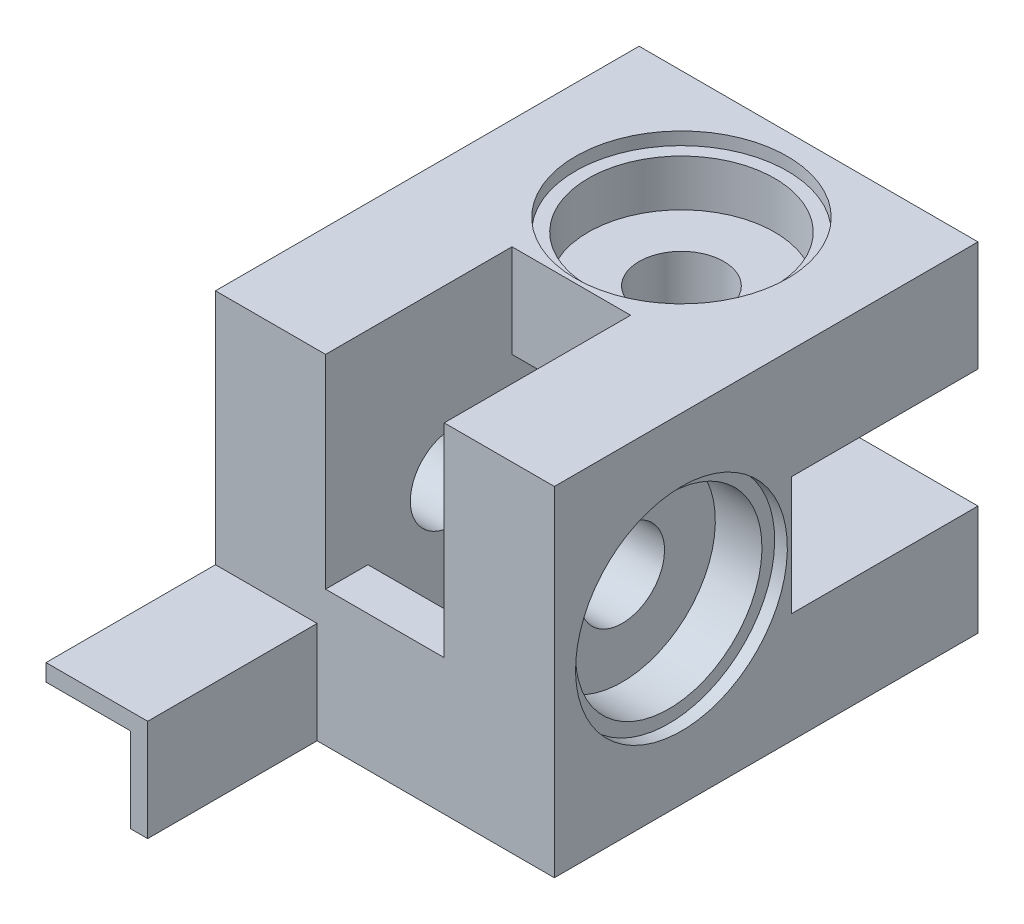
ISO-10303-21;
HEADER;
FILE_DESCRIPTION(('STEP AP214'),'2;1');
FILE_NAME('part.step','',(''),(''),'','','');
FILE_SCHEMA(('AUTOMOTIVE_DESIGN { 1 0 10303 214 1 1 1 1 }'));
ENDSEC;
DATA;
#1=APPLICATION_CONTEXT('core data for automotive mechanical design processes');
#2=APPLICATION_PROTOCOL_DEFINITION('international standard','automotive_design',2000,#1);
#3=PRODUCT_CONTEXT('',#1,'mechanical');
#4=PRODUCT('Part','Part','',(#3));
#5=PRODUCT_RELATED_PRODUCT_CATEGORY('part','',(#4));
#6=PRODUCT_DEFINITION_FORMATION('','',#4);
#7=PRODUCT_DEFINITION_CONTEXT('part definition',#1,'design');
#8=PRODUCT_DEFINITION('design','',#6,#7);
#9=PRODUCT_DEFINITION_SHAPE('','',#8);
#10=(LENGTH_UNIT() NAMED_UNIT(*) SI_UNIT(.MILLI.,.METRE.));
#11=(NAMED_UNIT(*) PLANE_ANGLE_UNIT() SI_UNIT($,.RADIAN.));
#12=(NAMED_UNIT(*) SI_UNIT($,.STERADIAN.) SOLID_ANGLE_UNIT());
#13=UNCERTAINTY_MEASURE_WITH_UNIT(LENGTH_MEASURE(1.E-05),#10,'distance_accuracy_value','');
#14=(GEOMETRIC_REPRESENTATION_CONTEXT(3) GLOBAL_UNCERTAINTY_ASSIGNED_CONTEXT((#13)) GLOBAL_UNIT_ASSIGNED_CONTEXT((#10,
#11,#12)) REPRESENTATION_CONTEXT('',''));
#15=CARTESIAN_POINT('',(0.,0.,0.));
#16=DIRECTION('',(0.,0.,1.));
#17=DIRECTION('',(1.,0.,0.));
#18=AXIS2_PLACEMENT_3D('',#15,#16,#17);
#19=CARTESIAN_POINT('',(0.,0.,50.));
#20=DIRECTION('',(0.,0.,1.));
#21=DIRECTION('',(1.,0.,0.));
#22=AXIS2_PLACEMENT_3D('',#19,#20,#21);
#23=PLANE('',#22);
#24=DIRECTION('',(-1.,0.,0.));
#25=VECTOR('',#24,1.);
#26=CARTESIAN_POINT('',(-28.,12.,50.));
#27=LINE('',#26,#25);
#28=CARTESIAN_POINT('',(-28.,12.,50.));
#29=VERTEX_POINT('',#28);
#30=CARTESIAN_POINT('',(-40.,12.,50.));
#31=VERTEX_POINT('',#30);
#32=EDGE_CURVE('E50',#29,#31,#27,.T.);
#33=ORIENTED_EDGE('',*,*,#32,.F.);
#34=DIRECTION('',(0.,1.,0.));
#35=VECTOR('',#34,1.);
#36=CARTESIAN_POINT('',(-28.,0.,50.));
#37=LINE('',#36,#35);
#38=CARTESIAN_POINT('',(-28.,0.,50.));
#39=VERTEX_POINT('',#38);
#40=EDGE_CURVE('E54',#39,#29,#37,.T.);
#41=ORIENTED_EDGE('',*,*,#40,.F.);
#42=DIRECTION('',(1.,0.,0.));
#43=VECTOR('',#42,1.);
#44=CARTESIAN_POINT('',(-40.,0.,50.));
#45=LINE('',#44,#43);
#46=CARTESIAN_POINT('',(0.,0.,50.));
#47=VERTEX_POINT('',#46);
#48=EDGE_CURVE('E428',#39,#47,#45,.T.);
#49=ORIENTED_EDGE('',*,*,#48,.T.);
#50=DIRECTION('',(0.,1.,0.));
#51=VECTOR('',#50,1.);
#52=CARTESIAN_POINT('',(0.,40.,50.));
#53=LINE('',#52,#51);
#54=CARTESIAN_POINT('',(0.,40.,50.));
#55=VERTEX_POINT('',#54);
#56=EDGE_CURVE('E479',#47,#55,#53,.T.);
#57=ORIENTED_EDGE('',*,*,#56,.T.);
#58=DIRECTION('',(-1.,0.,0.));
#59=VECTOR('',#58,1.);
#60=CARTESIAN_POINT('',(-40.,40.,50.));
#61=LINE('',#60,#59);
#62=CARTESIAN_POINT('',(-13.,40.,50.));
#63=VERTEX_POINT('',#62);
#64=EDGE_CURVE('E467',#55,#63,#61,.T.);
#65=ORIENTED_EDGE('',*,*,#64,.T.);
#66=DIRECTION('',(0.,1.,0.));
#67=VECTOR('',#66,1.);
#68=CARTESIAN_POINT('',(-13.,16.,50.));
#69=LINE('',#68,#67);
#70=CARTESIAN_POINT('',(-13.,16.,50.));
#71=VERTEX_POINT('',#70);
#72=EDGE_CURVE('E309',#71,#63,#69,.T.);
#73=ORIENTED_EDGE('',*,*,#72,.F.);
#74=DIRECTION('',(1.,0.,0.));
#75=VECTOR('',#74,1.);
#76=CARTESIAN_POINT('',(-27.,16.,50.));
#77=LINE('',#76,#75);
#78=CARTESIAN_POINT('',(-27.,16.,50.));
#79=VERTEX_POINT('',#78);
#80=EDGE_CURVE('E290',#79,#71,#77,.T.);
#81=ORIENTED_EDGE('',*,*,#80,.F.);
#82=DIRECTION('',(0.,1.,0.));
#83=VECTOR('',#82,1.);
#84=CARTESIAN_POINT('',(-27.,16.,50.));
#85=LINE('',#84,#83);
#86=CARTESIAN_POINT('',(-27.,40.,50.));
#87=VERTEX_POINT('',#86);
#88=EDGE_CURVE('E296',#79,#87,#85,.T.);
#89=ORIENTED_EDGE('',*,*,#88,.T.);
#90=CARTESIAN_POINT('',(-40.,40.,50.));
#91=VERTEX_POINT('',#90);
#92=EDGE_CURVE('E478',#87,#91,#61,.T.);
#93=ORIENTED_EDGE('',*,*,#92,.T.);
#94=DIRECTION('',(0.,-1.,0.));
#95=VECTOR('',#94,1.);
#96=CARTESIAN_POINT('',(-40.,40.,50.));
#97=LINE('',#96,#95);
#98=EDGE_CURVE('E426',#91,#31,#97,.T.);
#99=ORIENTED_EDGE('',*,*,#98,.T.);
#100=EDGE_LOOP('',(#33,#41,#49,#57,#65,#73,#81,#89,#93,#99));
#101=FACE_BOUND('',#100,.T.);
#102=ADVANCED_FACE('F33',(#101),#23,.T.);
#103=CARTESIAN_POINT('',(-20.,33.,15.));
#104=DIRECTION('',(0.,1.,0.));
#105=DIRECTION('',(0.,0.,1.));
#106=AXIS2_PLACEMENT_3D('',#103,#104,#105);
#107=CYLINDRICAL_SURFACE('',#106,11.);
#108=CARTESIAN_POINT('',(-20.,33.,15.));
#109=DIRECTION('',(0.,1.,0.));
#110=DIRECTION('',(0.,0.,1.));
#111=AXIS2_PLACEMENT_3D('',#108,#109,#110);
#112=CIRCLE('',#111,11.);
#113=CARTESIAN_POINT('',(-20.,33.,26.));
#114=VERTEX_POINT('',#113);
#115=EDGE_CURVE('E272',#114,#114,#112,.T.);
#116=ORIENTED_EDGE('',*,*,#115,.F.);
#117=EDGE_LOOP('',(#116));
#118=FACE_BOUND('',#117,.T.);
#119=CARTESIAN_POINT('',(-20.,38.5,15.));
#120=DIRECTION('',(0.,1.,0.));
#121=DIRECTION('',(0.,0.,1.));
#122=AXIS2_PLACEMENT_3D('',#119,#120,#121);
#123=CIRCLE('',#122,11.);
#124=CARTESIAN_POINT('',(-20.,38.5,26.));
#125=VERTEX_POINT('',#124);
#126=EDGE_CURVE('E270',#125,#125,#123,.F.);
#127=ORIENTED_EDGE('',*,*,#126,.F.);
#128=EDGE_LOOP('',(#127));
#129=FACE_BOUND('',#128,.T.);
#130=ADVANCED_FACE('F513',(#118,#129),#107,.F.);
#131=CARTESIAN_POINT('',(-20.,0.,15.));
#132=DIRECTION('',(0.,1.,0.));
#133=DIRECTION('',(0.,0.,1.));
#134=AXIS2_PLACEMENT_3D('',#131,#132,#133);
#135=CYLINDRICAL_SURFACE('',#134,5.);
#136=CARTESIAN_POINT('',(-20.,27.,15.));
#137=DIRECTION('',(0.,1.,0.));
#138=DIRECTION('',(0.,0.,1.));
#139=AXIS2_PLACEMENT_3D('',#136,#137,#138);
#140=CIRCLE('',#139,5.);
#141=CARTESIAN_POINT('',(-20.,27.,20.));
#142=VERTEX_POINT('',#141);
#143=EDGE_CURVE('E399',#142,#142,#140,.F.);
#144=ORIENTED_EDGE('',*,*,#143,.T.);
#145=EDGE_LOOP('',(#144));
#146=FACE_BOUND('',#145,.T.);
#147=CARTESIAN_POINT('',(-20.,33.,15.));
#148=DIRECTION('',(0.,1.,0.));
#149=DIRECTION('',(0.,0.,1.));
#150=AXIS2_PLACEMENT_3D('',#147,#148,#149);
#151=CIRCLE('',#150,5.);
#152=CARTESIAN_POINT('',(-20.,33.,20.));
#153=VERTEX_POINT('',#152);
#154=EDGE_CURVE('E275',#153,#153,#151,.F.);
#155=ORIENTED_EDGE('',*,*,#154,.F.);
#156=EDGE_LOOP('',(#155));
#157=FACE_BOUND('',#156,.T.);
#158=ADVANCED_FACE('F521',(#146,#157),#135,.F.);
#159=CARTESIAN_POINT('',(-7.,20.,35.));
#160=DIRECTION('',(1.,0.,0.));
#161=DIRECTION('',(0.,1.,0.));
#162=AXIS2_PLACEMENT_3D('',#159,#160,#161);
#163=CYLINDRICAL_SURFACE('',#162,11.);
#164=CARTESIAN_POINT('',(-7.,20.,35.));
#165=DIRECTION('',(1.,0.,0.));
#166=DIRECTION('',(0.,1.,0.));
#167=AXIS2_PLACEMENT_3D('',#164,#165,#166);
#168=CIRCLE('',#167,11.);
#169=CARTESIAN_POINT('',(-7.,31.,35.));
#170=VERTEX_POINT('',#169);
#171=EDGE_CURVE('E283',#170,#170,#168,.T.);
#172=ORIENTED_EDGE('',*,*,#171,.F.);
#173=EDGE_LOOP('',(#172));
#174=FACE_BOUND('',#173,.T.);
#175=CARTESIAN_POINT('',(-1.5,20.,35.));
#176=DIRECTION('',(1.,0.,0.));
#177=DIRECTION('',(0.,1.,0.));
#178=AXIS2_PLACEMENT_3D('',#175,#176,#177);
#179=CIRCLE('',#178,11.);
#180=CARTESIAN_POINT('',(-1.5,31.,35.));
#181=VERTEX_POINT('',#180);
#182=EDGE_CURVE('E279',#181,#181,#179,.F.);
#183=ORIENTED_EDGE('',*,*,#182,.F.);
#184=EDGE_LOOP('',(#183));
#185=FACE_BOUND('',#184,.T.);
#186=ADVANCED_FACE('F638',(#174,#185),#163,.F.);
#187=CARTESIAN_POINT('',(0.,20.,35.));
#188=DIRECTION('',(-1.,0.,0.));
#189=DIRECTION('',(0.,0.,1.));
#190=AXIS2_PLACEMENT_3D('',#187,#188,#189);
#191=CYLINDRICAL_SURFACE('',#190,5.);
#192=CARTESIAN_POINT('',(-13.,20.,35.));
#193=DIRECTION('',(1.,0.,0.));
#194=DIRECTION('',(0.,0.,-1.));
#195=AXIS2_PLACEMENT_3D('',#192,#193,#194);
#196=CIRCLE('',#195,5.);
#197=CARTESIAN_POINT('',(-13.,20.,30.));
#198=VERTEX_POINT('',#197);
#199=EDGE_CURVE('E372',#198,#198,#196,.F.);
#200=ORIENTED_EDGE('',*,*,#199,.T.);
#201=EDGE_LOOP('',(#200));
#202=FACE_BOUND('',#201,.T.);
#203=CARTESIAN_POINT('',(-7.,20.,35.));
#204=DIRECTION('',(1.,0.,0.));
#205=DIRECTION('',(0.,1.,0.));
#206=AXIS2_PLACEMENT_3D('',#203,#204,#205);
#207=CIRCLE('',#206,5.);
#208=CARTESIAN_POINT('',(-7.,25.,35.));
#209=VERTEX_POINT('',#208);
#210=EDGE_CURVE('E286',#209,#209,#207,.F.);
#211=ORIENTED_EDGE('',*,*,#210,.F.);
#212=EDGE_LOOP('',(#211));
#213=FACE_BOUND('',#212,.T.);
#214=ADVANCED_FACE('F636',(#202,#213),#191,.F.);
#215=CARTESIAN_POINT('',(-11.,27.,25.));
#216=DIRECTION('',(0.,0.,1.));
#217=DIRECTION('',(0.,-1.,0.));
#218=AXIS2_PLACEMENT_3D('',#215,#216,#217);
#219=PLANE('',#218);
#220=DIRECTION('',(-1.,0.,0.));
#221=VECTOR('',#220,1.);
#222=CARTESIAN_POINT('',(-11.,13.,25.));
#223=LINE('',#222,#221);
#224=CARTESIAN_POINT('',(-11.,13.,25.));
#225=VERTEX_POINT('',#224);
#226=CARTESIAN_POINT('',(-13.,13.,25.));
#227=VERTEX_POINT('',#226);
#228=EDGE_CURVE('E396',#225,#227,#223,.T.);
#229=ORIENTED_EDGE('',*,*,#228,.T.);
#230=DIRECTION('',(0.,1.,0.));
#231=VECTOR('',#230,1.);
#232=CARTESIAN_POINT('',(-13.,27.,25.));
#233=LINE('',#232,#231);
#234=CARTESIAN_POINT('',(-13.,27.,25.));
#235=VERTEX_POINT('',#234);
#236=EDGE_CURVE('E445',#227,#235,#233,.T.);
#237=ORIENTED_EDGE('',*,*,#236,.T.);
#238=DIRECTION('',(-1.,0.,0.));
#239=VECTOR('',#238,1.);
#240=CARTESIAN_POINT('',(-11.,27.,25.));
#241=LINE('',#240,#239);
#242=CARTESIAN_POINT('',(-11.,27.,25.));
#243=VERTEX_POINT('',#242);
#244=EDGE_CURVE('E406',#243,#235,#241,.T.);
#245=ORIENTED_EDGE('',*,*,#244,.F.);
#246=DIRECTION('',(0.,1.,0.));
#247=VECTOR('',#246,1.);
#248=CARTESIAN_POINT('',(-11.,27.,25.));
#249=LINE('',#248,#247);
#250=EDGE_CURVE('E376',#225,#243,#249,.T.);
#251=ORIENTED_EDGE('',*,*,#250,.F.);
#252=EDGE_LOOP('',(#229,#237,#245,#251));
#253=FACE_BOUND('',#252,.T.);
#254=ADVANCED_FACE('F609',(#253),#219,.F.);
#255=CARTESIAN_POINT('',(-20.,13.,15.));
#256=DIRECTION('',(0.,-1.,0.));
#257=DIRECTION('',(0.,0.,-1.));
#258=AXIS2_PLACEMENT_3D('',#255,#256,#257);
#259=CIRCLE('',#258,5.);
#260=CARTESIAN_POINT('',(-20.,13.,10.));
#261=VERTEX_POINT('',#260);
#262=EDGE_CURVE('E414',#261,#261,#259,.F.);
#263=ORIENTED_EDGE('',*,*,#262,.T.);
#264=EDGE_LOOP('',(#263));
#265=FACE_BOUND('',#264,.T.);
#266=CARTESIAN_POINT('',(-20.,0.,15.));
#267=DIRECTION('',(0.,1.,0.));
#268=DIRECTION('',(0.,0.,1.));
#269=AXIS2_PLACEMENT_3D('',#266,#267,#268);
#270=CIRCLE('',#269,5.);
#271=CARTESIAN_POINT('',(-20.,0.,20.));
#272=VERTEX_POINT('',#271);
#273=EDGE_CURVE('E413',#272,#272,#270,.T.);
#274=ORIENTED_EDGE('',*,*,#273,.F.);
#275=EDGE_LOOP('',(#274));
#276=FACE_BOUND('',#275,.T.);
#277=ADVANCED_FACE('F640',(#265,#276),#135,.F.);
#278=CARTESIAN_POINT('',(-40.,40.,50.));
#279=DIRECTION('',(1.,0.,0.));
#280=DIRECTION('',(0.,0.,-1.));
#281=AXIS2_PLACEMENT_3D('',#278,#279,#280);
#282=PLANE('',#281);
#283=DIRECTION('',(0.,0.,-1.));
#284=VECTOR('',#283,1.);
#285=CARTESIAN_POINT('',(-40.,27.,25.));
#286=LINE('',#285,#284);
#287=CARTESIAN_POINT('',(-40.,27.,25.));
#288=VERTEX_POINT('',#287);
#289=CARTESIAN_POINT('',(-40.,27.,5.));
#290=VERTEX_POINT('',#289);
#291=EDGE_CURVE('E388',#288,#290,#286,.T.);
#292=ORIENTED_EDGE('',*,*,#291,.F.);
#293=DIRECTION('',(0.,1.,0.));
#294=VECTOR('',#293,1.);
#295=CARTESIAN_POINT('',(-40.,27.,25.));
#296=LINE('',#295,#294);
#297=CARTESIAN_POINT('',(-40.,13.,25.));
#298=VERTEX_POINT('',#297);
#299=EDGE_CURVE('E375',#298,#288,#296,.T.);
#300=ORIENTED_EDGE('',*,*,#299,.F.);
#301=DIRECTION('',(0.,0.,1.));
#302=VECTOR('',#301,1.);
#303=CARTESIAN_POINT('',(-40.,13.,25.));
#304=LINE('',#303,#302);
#305=CARTESIAN_POINT('',(-40.,13.,5.));
#306=VERTEX_POINT('',#305);
#307=EDGE_CURVE('E380',#306,#298,#304,.T.);
#308=ORIENTED_EDGE('',*,*,#307,.F.);
#309=DIRECTION('',(0.,-1.,0.));
#310=VECTOR('',#309,1.);
#311=CARTESIAN_POINT('',(-40.,27.,5.));
#312=LINE('',#311,#310);
#313=EDGE_CURVE('E391',#290,#306,#312,.T.);
#314=ORIENTED_EDGE('',*,*,#313,.F.);
#315=EDGE_LOOP('',(#292,#300,#308,#314));
#316=FACE_BOUND('',#315,.T.);
#317=CARTESIAN_POINT('',(-40.,20.,35.));
#318=DIRECTION('',(-1.,0.,0.));
#319=DIRECTION('',(0.,0.,1.));
#320=AXIS2_PLACEMENT_3D('',#317,#318,#319);
#321=CIRCLE('',#320,5.);
#322=CARTESIAN_POINT('',(-40.,20.,40.));
#323=VERTEX_POINT('',#322);
#324=EDGE_CURVE('E410',#323,#323,#321,.T.);
#325=ORIENTED_EDGE('',*,*,#324,.F.);
#326=EDGE_LOOP('',(#325));
#327=FACE_BOUND('',#326,.T.);
#328=DIRECTION('',(0.,-1.,0.));
#329=VECTOR('',#328,1.);
#330=CARTESIAN_POINT('',(-40.,40.,0.));
#331=LINE('',#330,#329);
#332=CARTESIAN_POINT('',(-40.,40.,0.));
#333=VERTEX_POINT('',#332);
#334=CARTESIAN_POINT('',(-40.,0.,0.));
#335=VERTEX_POINT('',#334);
#336=EDGE_CURVE('E417',#333,#335,#331,.T.);
#337=ORIENTED_EDGE('',*,*,#336,.T.);
#338=DIRECTION('',(0.,0.,-1.));
#339=VECTOR('',#338,1.);
#340=CARTESIAN_POINT('',(-40.,0.,50.));
#341=LINE('',#340,#339);
#342=CARTESIAN_POINT('',(-40.,0.,50.));
#343=VERTEX_POINT('',#342);
#344=EDGE_CURVE('E451',#343,#335,#341,.T.);
#345=ORIENTED_EDGE('',*,*,#344,.F.);
#346=CARTESIAN_POINT('',(-40.,10.,50.));
#347=VERTEX_POINT('',#346);
#348=EDGE_CURVE('E242',#347,#343,#97,.T.);
#349=ORIENTED_EDGE('',*,*,#348,.F.);
#350=DIRECTION('',(0.,0.,-1.));
#351=VECTOR('',#350,1.);
#352=CARTESIAN_POINT('',(-40.,10.,70.));
#353=LINE('',#352,#351);
#354=CARTESIAN_POINT('',(-40.,10.,70.));
#355=VERTEX_POINT('',#354);
#356=EDGE_CURVE('E223',#355,#347,#353,.T.);
#357=ORIENTED_EDGE('',*,*,#356,.F.);
#358=DIRECTION('',(0.,-1.,0.));
#359=VECTOR('',#358,1.);
#360=CARTESIAN_POINT('',(-40.,12.,70.));
#361=LINE('',#360,#359);
#362=CARTESIAN_POINT('',(-40.,12.,70.));
#363=VERTEX_POINT('',#362);
#364=EDGE_CURVE('E229',#363,#355,#361,.T.);
#365=ORIENTED_EDGE('',*,*,#364,.F.);
#366=DIRECTION('',(0.,0.,-1.));
#367=VECTOR('',#366,1.);
#368=CARTESIAN_POINT('',(-40.,12.,70.));
#369=LINE('',#368,#367);
#370=EDGE_CURVE('E258',#363,#31,#369,.T.);
#371=ORIENTED_EDGE('',*,*,#370,.T.);
#372=ORIENTED_EDGE('',*,*,#98,.F.);
#373=DIRECTION('',(0.,0.,-1.));
#374=VECTOR('',#373,1.);
#375=CARTESIAN_POINT('',(-40.,40.,50.));
#376=LINE('',#375,#374);
#377=EDGE_CURVE('E464',#91,#333,#376,.T.);
#378=ORIENTED_EDGE('',*,*,#377,.T.);
#379=EDGE_LOOP('',(#337,#345,#349,#357,#365,#371,#372,#378));
#380=FACE_BOUND('',#379,.T.);
#381=ADVANCED_FACE('F35',(#316,#327,#380),#282,.F.);
#382=CARTESIAN_POINT('',(-40.,0.,50.));
#383=DIRECTION('',(0.,1.,0.));
#384=DIRECTION('',(0.,0.,1.));
#385=AXIS2_PLACEMENT_3D('',#382,#383,#384);
#386=PLANE('',#385);
#387=DIRECTION('',(-1.,0.,0.));
#388=VECTOR('',#387,1.);
#389=CARTESIAN_POINT('',(-13.,0.,45.));
#390=LINE('',#389,#388);
#391=CARTESIAN_POINT('',(-13.,0.,45.));
#392=VERTEX_POINT('',#391);
#393=CARTESIAN_POINT('',(-27.,0.,45.));
#394=VERTEX_POINT('',#393);
#395=EDGE_CURVE('E350',#392,#394,#390,.T.);
#396=ORIENTED_EDGE('',*,*,#395,.F.);
#397=DIRECTION('',(0.,0.,1.));
#398=VECTOR('',#397,1.);
#399=CARTESIAN_POINT('',(-13.,0.,25.));
#400=LINE('',#399,#398);
#401=CARTESIAN_POINT('',(-13.,0.,25.));
#402=VERTEX_POINT('',#401);
#403=EDGE_CURVE('E332',#402,#392,#400,.T.);
#404=ORIENTED_EDGE('',*,*,#403,.F.);
#405=DIRECTION('',(1.,0.,0.));
#406=VECTOR('',#405,1.);
#407=CARTESIAN_POINT('',(-13.,0.,25.));
#408=LINE('',#407,#406);
#409=CARTESIAN_POINT('',(-27.,0.,25.));
#410=VERTEX_POINT('',#409);
#411=EDGE_CURVE('E342',#410,#402,#408,.T.);
#412=ORIENTED_EDGE('',*,*,#411,.F.);
#413=DIRECTION('',(0.,0.,-1.));
#414=VECTOR('',#413,1.);
#415=CARTESIAN_POINT('',(-27.,0.,25.));
#416=LINE('',#415,#414);
#417=EDGE_CURVE('E353',#394,#410,#416,.T.);
#418=ORIENTED_EDGE('',*,*,#417,.F.);
#419=EDGE_LOOP('',(#396,#404,#412,#418));
#420=FACE_BOUND('',#419,.T.);
#421=ORIENTED_EDGE('',*,*,#273,.T.);
#422=EDGE_LOOP('',(#421));
#423=FACE_BOUND('',#422,.T.);
#424=DIRECTION('',(1.,0.,0.));
#425=VECTOR('',#424,1.);
#426=CARTESIAN_POINT('',(-40.,0.,0.));
#427=LINE('',#426,#425);
#428=CARTESIAN_POINT('',(0.,0.,0.));
#429=VERTEX_POINT('',#428);
#430=EDGE_CURVE('E474',#335,#429,#427,.T.);
#431=ORIENTED_EDGE('',*,*,#430,.T.);
#432=DIRECTION('',(0.,0.,-1.));
#433=VECTOR('',#432,1.);
#434=CARTESIAN_POINT('',(0.,0.,50.));
#435=LINE('',#434,#433);
#436=EDGE_CURVE('E458',#47,#429,#435,.T.);
#437=ORIENTED_EDGE('',*,*,#436,.F.);
#438=ORIENTED_EDGE('',*,*,#48,.F.);
#439=DIRECTION('',(0.,0.,-1.));
#440=VECTOR('',#439,1.);
#441=CARTESIAN_POINT('',(-28.,0.,70.));
#442=LINE('',#441,#440);
#443=CARTESIAN_POINT('',(-28.,0.,70.));
#444=VERTEX_POINT('',#443);
#445=EDGE_CURVE('E267',#444,#39,#442,.T.);
#446=ORIENTED_EDGE('',*,*,#445,.F.);
#447=DIRECTION('',(1.,0.,0.));
#448=VECTOR('',#447,1.);
#449=CARTESIAN_POINT('',(-30.,0.,70.));
#450=LINE('',#449,#448);
#451=CARTESIAN_POINT('',(-30.,0.,70.));
#452=VERTEX_POINT('',#451);
#453=EDGE_CURVE('E510',#452,#444,#450,.T.);
#454=ORIENTED_EDGE('',*,*,#453,.F.);
#455=DIRECTION('',(0.,0.,-1.));
#456=VECTOR('',#455,1.);
#457=CARTESIAN_POINT('',(-30.,0.,70.));
#458=LINE('',#457,#456);
#459=CARTESIAN_POINT('',(-30.,0.,50.));
#460=VERTEX_POINT('',#459);
#461=EDGE_CURVE('E248',#452,#460,#458,.T.);
#462=ORIENTED_EDGE('',*,*,#461,.T.);
#463=EDGE_CURVE('E480',#343,#460,#45,.T.);
#464=ORIENTED_EDGE('',*,*,#463,.F.);
#465=ORIENTED_EDGE('',*,*,#344,.T.);
#466=EDGE_LOOP('',(#431,#437,#438,#446,#454,#462,#464,#465));
#467=FACE_BOUND('',#466,.T.);
#468=ADVANCED_FACE('F509',(#420,#423,#467),#386,.F.);
#469=CARTESIAN_POINT('',(0.,40.,50.));
#470=DIRECTION('',(-1.,0.,0.));
#471=DIRECTION('',(0.,-1.,0.));
#472=AXIS2_PLACEMENT_3D('',#469,#470,#471);
#473=PLANE('',#472);
#474=CARTESIAN_POINT('',(0.,20.,35.));
#475=DIRECTION('',(1.,0.,0.));
#476=DIRECTION('',(0.,1.,0.));
#477=AXIS2_PLACEMENT_3D('',#474,#475,#476);
#478=CIRCLE('',#477,12.5);
#479=CARTESIAN_POINT('',(0.,32.5,35.));
#480=VERTEX_POINT('',#479);
#481=EDGE_CURVE('E280',#480,#480,#478,.T.);
#482=ORIENTED_EDGE('',*,*,#481,.F.);
#483=EDGE_LOOP('',(#482));
#484=FACE_BOUND('',#483,.T.);
#485=DIRECTION('',(0.,1.,0.));
#486=VECTOR('',#485,1.);
#487=CARTESIAN_POINT('',(0.,40.,0.));
#488=LINE('',#487,#486);
#489=CARTESIAN_POINT('',(0.,13.,0.));
#490=VERTEX_POINT('',#489);
#491=EDGE_CURVE('E470',#429,#490,#488,.T.);
#492=ORIENTED_EDGE('',*,*,#491,.T.);
#493=DIRECTION('',(0.,0.,-1.));
#494=VECTOR('',#493,1.);
#495=CARTESIAN_POINT('',(0.,13.,0.));
#496=LINE('',#495,#494);
#497=CARTESIAN_POINT('',(0.,13.,22.));
#498=VERTEX_POINT('',#497);
#499=EDGE_CURVE('E317',#498,#490,#496,.T.);
#500=ORIENTED_EDGE('',*,*,#499,.F.);
#501=DIRECTION('',(0.,-1.,0.));
#502=VECTOR('',#501,1.);
#503=CARTESIAN_POINT('',(0.,27.,22.));
#504=LINE('',#503,#502);
#505=CARTESIAN_POINT('',(0.,27.,22.));
#506=VERTEX_POINT('',#505);
#507=EDGE_CURVE('E325',#506,#498,#504,.T.);
#508=ORIENTED_EDGE('',*,*,#507,.F.);
#509=DIRECTION('',(0.,0.,1.));
#510=VECTOR('',#509,1.);
#511=CARTESIAN_POINT('',(0.,27.,0.));
#512=LINE('',#511,#510);
#513=CARTESIAN_POINT('',(0.,27.,0.));
#514=VERTEX_POINT('',#513);
#515=EDGE_CURVE('E306',#514,#506,#512,.T.);
#516=ORIENTED_EDGE('',*,*,#515,.F.);
#517=CARTESIAN_POINT('',(0.,40.,0.));
#518=VERTEX_POINT('',#517);
#519=EDGE_CURVE('E473',#514,#518,#488,.T.);
#520=ORIENTED_EDGE('',*,*,#519,.T.);
#521=DIRECTION('',(0.,0.,-1.));
#522=VECTOR('',#521,1.);
#523=CARTESIAN_POINT('',(0.,40.,50.));
#524=LINE('',#523,#522);
#525=EDGE_CURVE('E461',#55,#518,#524,.T.);
#526=ORIENTED_EDGE('',*,*,#525,.F.);
#527=ORIENTED_EDGE('',*,*,#56,.F.);
#528=ORIENTED_EDGE('',*,*,#436,.T.);
#529=EDGE_LOOP('',(#492,#500,#508,#516,#520,#526,#527,#528));
#530=FACE_BOUND('',#529,.T.);
#531=ADVANCED_FACE('F537',(#484,#530),#473,.F.);
#532=CARTESIAN_POINT('',(-40.,40.,50.));
#533=DIRECTION('',(0.,-1.,0.));
#534=DIRECTION('',(0.,0.,-1.));
#535=AXIS2_PLACEMENT_3D('',#532,#533,#534);
#536=PLANE('',#535);
#537=CARTESIAN_POINT('',(-20.,40.,15.));
#538=DIRECTION('',(0.,1.,0.));
#539=DIRECTION('',(0.,0.,1.));
#540=AXIS2_PLACEMENT_3D('',#537,#538,#539);
#541=CIRCLE('',#540,12.5);
#542=CARTESIAN_POINT('',(-20.,40.,27.5));
#543=VERTEX_POINT('',#542);
#544=EDGE_CURVE('E243',#543,#543,#541,.T.);
#545=ORIENTED_EDGE('',*,*,#544,.F.);
#546=EDGE_LOOP('',(#545));
#547=FACE_BOUND('',#546,.T.);
#548=ORIENTED_EDGE('',*,*,#92,.F.);
#549=DIRECTION('',(0.,0.,1.));
#550=VECTOR('',#549,1.);
#551=CARTESIAN_POINT('',(-27.,40.,50.));
#552=LINE('',#551,#550);
#553=CARTESIAN_POINT('',(-27.,40.,28.));
#554=VERTEX_POINT('',#553);
#555=EDGE_CURVE('E297',#554,#87,#552,.T.);
#556=ORIENTED_EDGE('',*,*,#555,.F.);
#557=DIRECTION('',(-1.,0.,0.));
#558=VECTOR('',#557,1.);
#559=CARTESIAN_POINT('',(-27.,40.,28.));
#560=LINE('',#559,#558);
#561=CARTESIAN_POINT('',(-13.,40.,28.));
#562=VERTEX_POINT('',#561);
#563=EDGE_CURVE('E291',#562,#554,#560,.T.);
#564=ORIENTED_EDGE('',*,*,#563,.F.);
#565=DIRECTION('',(0.,0.,-1.));
#566=VECTOR('',#565,1.);
#567=CARTESIAN_POINT('',(-13.,40.,50.));
#568=LINE('',#567,#566);
#569=EDGE_CURVE('E299',#63,#562,#568,.T.);
#570=ORIENTED_EDGE('',*,*,#569,.F.);
#571=ORIENTED_EDGE('',*,*,#64,.F.);
#572=ORIENTED_EDGE('',*,*,#525,.T.);
#573=DIRECTION('',(-1.,0.,0.));
#574=VECTOR('',#573,1.);
#575=CARTESIAN_POINT('',(-40.,40.,0.));
#576=LINE('',#575,#574);
#577=EDGE_CURVE('E468',#518,#333,#576,.T.);
#578=ORIENTED_EDGE('',*,*,#577,.T.);
#579=ORIENTED_EDGE('',*,*,#377,.F.);
#580=EDGE_LOOP('',(#548,#556,#564,#570,#571,#572,#578,#579));
#581=FACE_BOUND('',#580,.T.);
#582=ADVANCED_FACE('F528',(#547,#581),#536,.F.);
#583=DIRECTION('',(0.,-1.,0.));
#584=VECTOR('',#583,1.);
#585=CARTESIAN_POINT('',(-30.,10.,50.));
#586=LINE('',#585,#584);
#587=CARTESIAN_POINT('',(-30.,10.,50.));
#588=VERTEX_POINT('',#587);
#589=EDGE_CURVE('E488',#588,#460,#586,.T.);
#590=ORIENTED_EDGE('',*,*,#589,.F.);
#591=DIRECTION('',(1.,0.,0.));
#592=VECTOR('',#591,1.);
#593=CARTESIAN_POINT('',(-40.,10.,50.));
#594=LINE('',#593,#592);
#595=EDGE_CURVE('E487',#347,#588,#594,.T.);
#596=ORIENTED_EDGE('',*,*,#595,.F.);
#597=ORIENTED_EDGE('',*,*,#348,.T.);
#598=ORIENTED_EDGE('',*,*,#463,.T.);
#599=EDGE_LOOP('',(#590,#596,#597,#598));
#600=FACE_BOUND('',#599,.T.);
#601=ADVANCED_FACE('F515',(#600),#23,.T.);
#602=CARTESIAN_POINT('',(0.,0.,0.));
#603=DIRECTION('',(0.,0.,1.));
#604=DIRECTION('',(1.,0.,0.));
#605=AXIS2_PLACEMENT_3D('',#602,#603,#604);
#606=PLANE('',#605);
#607=DIRECTION('',(0.,1.,0.));
#608=VECTOR('',#607,1.);
#609=CARTESIAN_POINT('',(-24.,27.,0.));
#610=LINE('',#609,#608);
#611=CARTESIAN_POINT('',(-24.,13.,0.));
#612=VERTEX_POINT('',#611);
#613=CARTESIAN_POINT('',(-24.,27.,0.));
#614=VERTEX_POINT('',#613);
#615=EDGE_CURVE('E313',#612,#614,#610,.T.);
#616=ORIENTED_EDGE('',*,*,#615,.F.);
#617=DIRECTION('',(1.,0.,0.));
#618=VECTOR('',#617,1.);
#619=CARTESIAN_POINT('',(-24.,13.,0.));
#620=LINE('',#619,#618);
#621=EDGE_CURVE('E329',#612,#490,#620,.T.);
#622=ORIENTED_EDGE('',*,*,#621,.T.);
#623=ORIENTED_EDGE('',*,*,#491,.F.);
#624=ORIENTED_EDGE('',*,*,#430,.F.);
#625=ORIENTED_EDGE('',*,*,#336,.F.);
#626=ORIENTED_EDGE('',*,*,#577,.F.);
#627=ORIENTED_EDGE('',*,*,#519,.F.);
#628=DIRECTION('',(1.,0.,0.));
#629=VECTOR('',#628,1.);
#630=CARTESIAN_POINT('',(-24.,27.,0.));
#631=LINE('',#630,#629);
#632=EDGE_CURVE('E322',#614,#514,#631,.T.);
#633=ORIENTED_EDGE('',*,*,#632,.F.);
#634=EDGE_LOOP('',(#616,#622,#623,#624,#625,#626,#627,#633));
#635=FACE_BOUND('',#634,.T.);
#636=ADVANCED_FACE('F527',(#635),#606,.F.);
#637=CARTESIAN_POINT('',(-27.,20.,35.));
#638=DIRECTION('',(-1.,0.,0.));
#639=DIRECTION('',(0.,0.,1.));
#640=AXIS2_PLACEMENT_3D('',#637,#638,#639);
#641=CIRCLE('',#640,5.);
#642=CARTESIAN_POINT('',(-27.,20.,40.));
#643=VERTEX_POINT('',#642);
#644=EDGE_CURVE('E361',#643,#643,#641,.F.);
#645=ORIENTED_EDGE('',*,*,#644,.T.);
#646=EDGE_LOOP('',(#645));
#647=FACE_BOUND('',#646,.T.);
#648=ORIENTED_EDGE('',*,*,#324,.T.);
#649=EDGE_LOOP('',(#648));
#650=FACE_BOUND('',#649,.T.);
#651=ADVANCED_FACE('F534',(#647,#650),#191,.F.);
#652=CARTESIAN_POINT('',(-11.,13.,25.));
#653=DIRECTION('',(0.,-1.,0.));
#654=DIRECTION('',(0.,0.,-1.));
#655=AXIS2_PLACEMENT_3D('',#652,#653,#654);
#656=PLANE('',#655);
#657=ORIENTED_EDGE('',*,*,#262,.F.);
#658=EDGE_LOOP('',(#657));
#659=FACE_BOUND('',#658,.T.);
#660=DIRECTION('',(0.,0.,1.));
#661=VECTOR('',#660,1.);
#662=CARTESIAN_POINT('',(-11.,13.,25.));
#663=LINE('',#662,#661);
#664=CARTESIAN_POINT('',(-11.,13.,22.));
#665=VERTEX_POINT('',#664);
#666=EDGE_CURVE('E383',#665,#225,#663,.T.);
#667=ORIENTED_EDGE('',*,*,#666,.F.);
#668=DIRECTION('',(1.,0.,0.));
#669=VECTOR('',#668,1.);
#670=CARTESIAN_POINT('',(-24.,13.,22.));
#671=LINE('',#670,#669);
#672=EDGE_CURVE('E333',#665,#498,#671,.T.);
#673=ORIENTED_EDGE('',*,*,#672,.T.);
#674=ORIENTED_EDGE('',*,*,#499,.T.);
#675=ORIENTED_EDGE('',*,*,#621,.F.);
#676=DIRECTION('',(0.,0.,-1.));
#677=VECTOR('',#676,1.);
#678=CARTESIAN_POINT('',(-24.,13.,0.));
#679=LINE('',#678,#677);
#680=CARTESIAN_POINT('',(-24.,13.,5.));
#681=VERTEX_POINT('',#680);
#682=EDGE_CURVE('E319',#681,#612,#679,.T.);
#683=ORIENTED_EDGE('',*,*,#682,.F.);
#684=DIRECTION('',(-1.,0.,0.));
#685=VECTOR('',#684,1.);
#686=CARTESIAN_POINT('',(-11.,13.,5.));
#687=LINE('',#686,#685);
#688=EDGE_CURVE('E402',#681,#306,#687,.T.);
#689=ORIENTED_EDGE('',*,*,#688,.T.);
#690=ORIENTED_EDGE('',*,*,#307,.T.);
#691=CARTESIAN_POINT('',(-27.,13.,25.));
#692=VERTEX_POINT('',#691);
#693=EDGE_CURVE('E401',#692,#298,#223,.T.);
#694=ORIENTED_EDGE('',*,*,#693,.F.);
#695=EDGE_CURVE('E400',#227,#692,#223,.T.);
#696=ORIENTED_EDGE('',*,*,#695,.F.);
#697=ORIENTED_EDGE('',*,*,#228,.F.);
#698=EDGE_LOOP('',(#667,#673,#674,#675,#683,#689,#690,#694,#696,#697));
#699=FACE_BOUND('',#698,.T.);
#700=ADVANCED_FACE('F590',(#659,#699),#656,.F.);
#701=CARTESIAN_POINT('',(-11.,27.,25.));
#702=DIRECTION('',(0.,1.,0.));
#703=DIRECTION('',(0.,0.,1.));
#704=AXIS2_PLACEMENT_3D('',#701,#702,#703);
#705=PLANE('',#704);
#706=DIRECTION('',(1.,0.,0.));
#707=VECTOR('',#706,1.);
#708=CARTESIAN_POINT('',(-24.,27.,22.));
#709=LINE('',#708,#707);
#710=CARTESIAN_POINT('',(-11.,27.,22.));
#711=VERTEX_POINT('',#710);
#712=EDGE_CURVE('E335',#711,#506,#709,.T.);
#713=ORIENTED_EDGE('',*,*,#712,.F.);
#714=DIRECTION('',(0.,0.,-1.));
#715=VECTOR('',#714,1.);
#716=CARTESIAN_POINT('',(-11.,27.,25.));
#717=LINE('',#716,#715);
#718=EDGE_CURVE('E379',#243,#711,#717,.T.);
#719=ORIENTED_EDGE('',*,*,#718,.F.);
#720=ORIENTED_EDGE('',*,*,#244,.T.);
#721=CARTESIAN_POINT('',(-27.,27.,25.));
#722=VERTEX_POINT('',#721);
#723=EDGE_CURVE('E409',#235,#722,#241,.T.);
#724=ORIENTED_EDGE('',*,*,#723,.T.);
#725=EDGE_CURVE('E385',#722,#288,#241,.T.);
#726=ORIENTED_EDGE('',*,*,#725,.T.);
#727=ORIENTED_EDGE('',*,*,#291,.T.);
#728=DIRECTION('',(-1.,0.,0.));
#729=VECTOR('',#728,1.);
#730=CARTESIAN_POINT('',(-11.,27.,5.));
#731=LINE('',#730,#729);
#732=CARTESIAN_POINT('',(-24.,27.,5.));
#733=VERTEX_POINT('',#732);
#734=EDGE_CURVE('E404',#733,#290,#731,.T.);
#735=ORIENTED_EDGE('',*,*,#734,.F.);
#736=DIRECTION('',(0.,0.,1.));
#737=VECTOR('',#736,1.);
#738=CARTESIAN_POINT('',(-24.,27.,0.));
#739=LINE('',#738,#737);
#740=EDGE_CURVE('E316',#614,#733,#739,.T.);
#741=ORIENTED_EDGE('',*,*,#740,.F.);
#742=ORIENTED_EDGE('',*,*,#632,.T.);
#743=ORIENTED_EDGE('',*,*,#515,.T.);
#744=EDGE_LOOP('',(#713,#719,#720,#724,#726,#727,#735,#741,#742,#743));
#745=FACE_BOUND('',#744,.T.);
#746=ORIENTED_EDGE('',*,*,#143,.F.);
#747=EDGE_LOOP('',(#746));
#748=FACE_BOUND('',#747,.T.);
#749=ADVANCED_FACE('F601',(#745,#748),#705,.F.);
#750=ORIENTED_EDGE('',*,*,#725,.F.);
#751=DIRECTION('',(0.,-1.,0.));
#752=VECTOR('',#751,1.);
#753=CARTESIAN_POINT('',(-27.,27.,25.));
#754=LINE('',#753,#752);
#755=EDGE_CURVE('E448',#722,#692,#754,.T.);
#756=ORIENTED_EDGE('',*,*,#755,.T.);
#757=ORIENTED_EDGE('',*,*,#693,.T.);
#758=ORIENTED_EDGE('',*,*,#299,.T.);
#759=EDGE_LOOP('',(#750,#756,#757,#758));
#760=FACE_BOUND('',#759,.T.);
#761=ADVANCED_FACE('F587',(#760),#219,.F.);
#762=CARTESIAN_POINT('',(-11.,27.,5.));
#763=DIRECTION('',(0.,0.,-1.));
#764=DIRECTION('',(0.,1.,0.));
#765=AXIS2_PLACEMENT_3D('',#762,#763,#764);
#766=PLANE('',#765);
#767=ORIENTED_EDGE('',*,*,#688,.F.);
#768=DIRECTION('',(0.,1.,0.));
#769=VECTOR('',#768,1.);
#770=CARTESIAN_POINT('',(-24.,27.,5.));
#771=LINE('',#770,#769);
#772=EDGE_CURVE('E439',#681,#733,#771,.T.);
#773=ORIENTED_EDGE('',*,*,#772,.T.);
#774=ORIENTED_EDGE('',*,*,#734,.T.);
#775=ORIENTED_EDGE('',*,*,#313,.T.);
#776=EDGE_LOOP('',(#767,#773,#774,#775));
#777=FACE_BOUND('',#776,.T.);
#778=ADVANCED_FACE('F621',(#777),#766,.F.);
#779=CARTESIAN_POINT('',(-11.,0.,0.));
#780=DIRECTION('',(1.,0.,0.));
#781=DIRECTION('',(0.,0.,-1.));
#782=AXIS2_PLACEMENT_3D('',#779,#780,#781);
#783=PLANE('',#782);
#784=ORIENTED_EDGE('',*,*,#718,.T.);
#785=DIRECTION('',(0.,-1.,0.));
#786=VECTOR('',#785,1.);
#787=CARTESIAN_POINT('',(-11.,0.,22.));
#788=LINE('',#787,#786);
#789=EDGE_CURVE('E442',#711,#665,#788,.T.);
#790=ORIENTED_EDGE('',*,*,#789,.T.);
#791=ORIENTED_EDGE('',*,*,#666,.T.);
#792=ORIENTED_EDGE('',*,*,#250,.T.);
#793=EDGE_LOOP('',(#784,#790,#791,#792));
#794=FACE_BOUND('',#793,.T.);
#795=ADVANCED_FACE('F612',(#794),#783,.F.);
#796=CARTESIAN_POINT('',(-13.,29.,25.));
#797=DIRECTION('',(0.,0.,-1.));
#798=DIRECTION('',(-1.,0.,0.));
#799=AXIS2_PLACEMENT_3D('',#796,#797,#798);
#800=PLANE('',#799);
#801=DIRECTION('',(0.,-1.,0.));
#802=VECTOR('',#801,1.);
#803=CARTESIAN_POINT('',(-27.,29.,25.));
#804=LINE('',#803,#802);
#805=EDGE_CURVE('E366',#692,#410,#804,.T.);
#806=ORIENTED_EDGE('',*,*,#805,.T.);
#807=ORIENTED_EDGE('',*,*,#411,.T.);
#808=DIRECTION('',(0.,-1.,0.));
#809=VECTOR('',#808,1.);
#810=CARTESIAN_POINT('',(-13.,29.,25.));
#811=LINE('',#810,#809);
#812=EDGE_CURVE('E362',#227,#402,#811,.T.);
#813=ORIENTED_EDGE('',*,*,#812,.F.);
#814=ORIENTED_EDGE('',*,*,#695,.T.);
#815=EDGE_LOOP('',(#806,#807,#813,#814));
#816=FACE_BOUND('',#815,.T.);
#817=ADVANCED_FACE('F580',(#816),#800,.F.);
#818=CARTESIAN_POINT('',(-13.,29.,25.));
#819=VERTEX_POINT('',#818);
#820=EDGE_CURVE('E358',#819,#235,#811,.T.);
#821=ORIENTED_EDGE('',*,*,#820,.F.);
#822=DIRECTION('',(1.,0.,0.));
#823=VECTOR('',#822,1.);
#824=CARTESIAN_POINT('',(-13.,29.,25.));
#825=LINE('',#824,#823);
#826=CARTESIAN_POINT('',(-27.,29.,25.));
#827=VERTEX_POINT('',#826);
#828=EDGE_CURVE('E344',#827,#819,#825,.T.);
#829=ORIENTED_EDGE('',*,*,#828,.F.);
#830=EDGE_CURVE('E363',#827,#722,#804,.T.);
#831=ORIENTED_EDGE('',*,*,#830,.T.);
#832=ORIENTED_EDGE('',*,*,#723,.F.);
#833=EDGE_LOOP('',(#821,#829,#831,#832));
#834=FACE_BOUND('',#833,.T.);
#835=ADVANCED_FACE('F605',(#834),#800,.F.);
#836=CARTESIAN_POINT('',(-13.,29.,25.));
#837=DIRECTION('',(1.,0.,0.));
#838=DIRECTION('',(0.,0.,-1.));
#839=AXIS2_PLACEMENT_3D('',#836,#837,#838);
#840=PLANE('',#839);
#841=DIRECTION('',(0.,1.,0.));
#842=VECTOR('',#841,1.);
#843=CARTESIAN_POINT('',(-13.,16.,28.));
#844=LINE('',#843,#842);
#845=CARTESIAN_POINT('',(-13.,29.,28.));
#846=VERTEX_POINT('',#845);
#847=EDGE_CURVE('E307',#846,#562,#844,.T.);
#848=ORIENTED_EDGE('',*,*,#847,.F.);
#849=DIRECTION('',(0.,0.,1.));
#850=VECTOR('',#849,1.);
#851=CARTESIAN_POINT('',(-13.,29.,25.));
#852=LINE('',#851,#850);
#853=EDGE_CURVE('E338',#819,#846,#852,.T.);
#854=ORIENTED_EDGE('',*,*,#853,.F.);
#855=ORIENTED_EDGE('',*,*,#820,.T.);
#856=ORIENTED_EDGE('',*,*,#236,.F.);
#857=ORIENTED_EDGE('',*,*,#812,.T.);
#858=ORIENTED_EDGE('',*,*,#403,.T.);
#859=DIRECTION('',(0.,-1.,0.));
#860=VECTOR('',#859,1.);
#861=CARTESIAN_POINT('',(-13.,29.,45.));
#862=LINE('',#861,#860);
#863=CARTESIAN_POINT('',(-13.,16.,45.));
#864=VERTEX_POINT('',#863);
#865=EDGE_CURVE('E347',#864,#392,#862,.T.);
#866=ORIENTED_EDGE('',*,*,#865,.F.);
#867=DIRECTION('',(0.,0.,-1.));
#868=VECTOR('',#867,1.);
#869=CARTESIAN_POINT('',(-13.,16.,50.));
#870=LINE('',#869,#868);
#871=EDGE_CURVE('E294',#71,#864,#870,.T.);
#872=ORIENTED_EDGE('',*,*,#871,.F.);
#873=ORIENTED_EDGE('',*,*,#72,.T.);
#874=ORIENTED_EDGE('',*,*,#569,.T.);
#875=EDGE_LOOP('',(#848,#854,#855,#856,#857,#858,#866,#872,#873,#874));
#876=FACE_BOUND('',#875,.T.);
#877=ORIENTED_EDGE('',*,*,#199,.F.);
#878=EDGE_LOOP('',(#877));
#879=FACE_BOUND('',#878,.T.);
#880=ADVANCED_FACE('F558',(#876,#879),#840,.F.);
#881=CARTESIAN_POINT('',(-27.,29.,25.));
#882=DIRECTION('',(-1.,0.,0.));
#883=DIRECTION('',(0.,0.,1.));
#884=AXIS2_PLACEMENT_3D('',#881,#882,#883);
#885=PLANE('',#884);
#886=ORIENTED_EDGE('',*,*,#644,.F.);
#887=EDGE_LOOP('',(#886));
#888=FACE_BOUND('',#887,.T.);
#889=DIRECTION('',(0.,0.,-1.));
#890=VECTOR('',#889,1.);
#891=CARTESIAN_POINT('',(-27.,29.,25.));
#892=LINE('',#891,#890);
#893=CARTESIAN_POINT('',(-27.,29.,28.));
#894=VERTEX_POINT('',#893);
#895=EDGE_CURVE('E341',#894,#827,#892,.T.);
#896=ORIENTED_EDGE('',*,*,#895,.F.);
#897=DIRECTION('',(0.,1.,0.));
#898=VECTOR('',#897,1.);
#899=CARTESIAN_POINT('',(-27.,16.,28.));
#900=LINE('',#899,#898);
#901=EDGE_CURVE('E304',#894,#554,#900,.T.);
#902=ORIENTED_EDGE('',*,*,#901,.T.);
#903=ORIENTED_EDGE('',*,*,#555,.T.);
#904=ORIENTED_EDGE('',*,*,#88,.F.);
#905=DIRECTION('',(0.,0.,1.));
#906=VECTOR('',#905,1.);
#907=CARTESIAN_POINT('',(-27.,16.,50.));
#908=LINE('',#907,#906);
#909=CARTESIAN_POINT('',(-27.,16.,45.));
#910=VERTEX_POINT('',#909);
#911=EDGE_CURVE('E287',#910,#79,#908,.T.);
#912=ORIENTED_EDGE('',*,*,#911,.F.);
#913=DIRECTION('',(0.,-1.,0.));
#914=VECTOR('',#913,1.);
#915=CARTESIAN_POINT('',(-27.,29.,45.));
#916=LINE('',#915,#914);
#917=EDGE_CURVE('E367',#910,#394,#916,.T.);
#918=ORIENTED_EDGE('',*,*,#917,.T.);
#919=ORIENTED_EDGE('',*,*,#417,.T.);
#920=ORIENTED_EDGE('',*,*,#805,.F.);
#921=ORIENTED_EDGE('',*,*,#755,.F.);
#922=ORIENTED_EDGE('',*,*,#830,.F.);
#923=EDGE_LOOP('',(#896,#902,#903,#904,#912,#918,#919,#920,#921,#922));
#924=FACE_BOUND('',#923,.T.);
#925=ADVANCED_FACE('F567',(#888,#924),#885,.F.);
#926=CARTESIAN_POINT('',(-13.,29.,45.));
#927=DIRECTION('',(0.,0.,1.));
#928=DIRECTION('',(1.,0.,0.));
#929=AXIS2_PLACEMENT_3D('',#926,#927,#928);
#930=PLANE('',#929);
#931=ORIENTED_EDGE('',*,*,#917,.F.);
#932=DIRECTION('',(1.,0.,0.));
#933=VECTOR('',#932,1.);
#934=CARTESIAN_POINT('',(-13.,16.,45.));
#935=LINE('',#934,#933);
#936=EDGE_CURVE('E11',#910,#864,#935,.T.);
#937=ORIENTED_EDGE('',*,*,#936,.T.);
#938=ORIENTED_EDGE('',*,*,#865,.T.);
#939=ORIENTED_EDGE('',*,*,#395,.T.);
#940=EDGE_LOOP('',(#931,#937,#938,#939));
#941=FACE_BOUND('',#940,.T.);
#942=ADVANCED_FACE('F569',(#941),#930,.F.);
#943=CARTESIAN_POINT('',(0.,29.,0.));
#944=DIRECTION('',(0.,-1.,0.));
#945=DIRECTION('',(0.,0.,-1.));
#946=AXIS2_PLACEMENT_3D('',#943,#944,#945);
#947=PLANE('',#946);
#948=DIRECTION('',(1.,0.,0.));
#949=VECTOR('',#948,1.);
#950=CARTESIAN_POINT('',(0.,29.,28.));
#951=LINE('',#950,#949);
#952=EDGE_CURVE('E42',#894,#846,#951,.T.);
#953=ORIENTED_EDGE('',*,*,#952,.F.);
#954=ORIENTED_EDGE('',*,*,#895,.T.);
#955=ORIENTED_EDGE('',*,*,#828,.T.);
#956=ORIENTED_EDGE('',*,*,#853,.T.);
#957=EDGE_LOOP('',(#953,#954,#955,#956));
#958=FACE_BOUND('',#957,.T.);
#959=ADVANCED_FACE('F697',(#958),#947,.T.);
#960=CARTESIAN_POINT('',(-24.,0.,0.));
#961=DIRECTION('',(-1.,0.,0.));
#962=DIRECTION('',(0.,-1.,0.));
#963=AXIS2_PLACEMENT_3D('',#960,#961,#962);
#964=PLANE('',#963);
#965=ORIENTED_EDGE('',*,*,#682,.T.);
#966=ORIENTED_EDGE('',*,*,#615,.T.);
#967=ORIENTED_EDGE('',*,*,#740,.T.);
#968=ORIENTED_EDGE('',*,*,#772,.F.);
#969=EDGE_LOOP('',(#965,#966,#967,#968));
#970=FACE_BOUND('',#969,.T.);
#971=ADVANCED_FACE('F619',(#970),#964,.F.);
#972=CARTESIAN_POINT('',(-24.,27.,22.));
#973=DIRECTION('',(0.,0.,1.));
#974=DIRECTION('',(0.,-1.,0.));
#975=AXIS2_PLACEMENT_3D('',#972,#973,#974);
#976=PLANE('',#975);
#977=ORIENTED_EDGE('',*,*,#712,.T.);
#978=ORIENTED_EDGE('',*,*,#507,.T.);
#979=ORIENTED_EDGE('',*,*,#672,.F.);
#980=ORIENTED_EDGE('',*,*,#789,.F.);
#981=EDGE_LOOP('',(#977,#978,#979,#980));
#982=FACE_BOUND('',#981,.T.);
#983=ADVANCED_FACE('F615',(#982),#976,.F.);
#984=CARTESIAN_POINT('',(0.,16.,0.));
#985=DIRECTION('',(0.,-1.,0.));
#986=DIRECTION('',(0.,0.,-1.));
#987=AXIS2_PLACEMENT_3D('',#984,#985,#986);
#988=PLANE('',#987);
#989=ORIENTED_EDGE('',*,*,#911,.T.);
#990=ORIENTED_EDGE('',*,*,#80,.T.);
#991=ORIENTED_EDGE('',*,*,#871,.T.);
#992=ORIENTED_EDGE('',*,*,#936,.F.);
#993=EDGE_LOOP('',(#989,#990,#991,#992));
#994=FACE_BOUND('',#993,.T.);
#995=ADVANCED_FACE('F562',(#994),#988,.F.);
#996=CARTESIAN_POINT('',(-27.,16.,28.));
#997=DIRECTION('',(0.,0.,-1.));
#998=DIRECTION('',(-1.,0.,0.));
#999=AXIS2_PLACEMENT_3D('',#996,#997,#998);
#1000=PLANE('',#999);
#1001=ORIENTED_EDGE('',*,*,#952,.T.);
#1002=ORIENTED_EDGE('',*,*,#847,.T.);
#1003=ORIENTED_EDGE('',*,*,#563,.T.);
#1004=ORIENTED_EDGE('',*,*,#901,.F.);
#1005=EDGE_LOOP('',(#1001,#1002,#1003,#1004));
#1006=FACE_BOUND('',#1005,.T.);
#1007=ADVANCED_FACE('F687',(#1006),#1000,.F.);
#1008=CARTESIAN_POINT('',(-7.,20.,35.));
#1009=DIRECTION('',(1.,0.,0.));
#1010=DIRECTION('',(0.,1.,0.));
#1011=AXIS2_PLACEMENT_3D('',#1008,#1009,#1010);
#1012=PLANE('',#1011);
#1013=ORIENTED_EDGE('',*,*,#171,.T.);
#1014=EDGE_LOOP('',(#1013));
#1015=FACE_BOUND('',#1014,.T.);
#1016=ORIENTED_EDGE('',*,*,#210,.T.);
#1017=EDGE_LOOP('',(#1016));
#1018=FACE_BOUND('',#1017,.T.);
#1019=ADVANCED_FACE('F681',(#1015,#1018),#1012,.T.);
#1020=CARTESIAN_POINT('',(-1.5,20.,35.));
#1021=DIRECTION('',(1.,0.,0.));
#1022=DIRECTION('',(0.,1.,0.));
#1023=AXIS2_PLACEMENT_3D('',#1020,#1021,#1022);
#1024=PLANE('',#1023);
#1025=CARTESIAN_POINT('',(-1.5,20.,35.));
#1026=DIRECTION('',(1.,0.,0.));
#1027=DIRECTION('',(0.,1.,0.));
#1028=AXIS2_PLACEMENT_3D('',#1025,#1026,#1027);
#1029=CIRCLE('',#1028,12.5);
#1030=CARTESIAN_POINT('',(-1.5,32.5,35.));
#1031=VERTEX_POINT('',#1030);
#1032=EDGE_CURVE('E276',#1031,#1031,#1029,.T.);
#1033=ORIENTED_EDGE('',*,*,#1032,.T.);
#1034=EDGE_LOOP('',(#1033));
#1035=FACE_BOUND('',#1034,.T.);
#1036=ORIENTED_EDGE('',*,*,#182,.T.);
#1037=EDGE_LOOP('',(#1036));
#1038=FACE_BOUND('',#1037,.T.);
#1039=ADVANCED_FACE('F671',(#1035,#1038),#1024,.T.);
#1040=CARTESIAN_POINT('',(-1.5,20.,35.));
#1041=DIRECTION('',(1.,0.,0.));
#1042=DIRECTION('',(0.,1.,0.));
#1043=AXIS2_PLACEMENT_3D('',#1040,#1041,#1042);
#1044=CYLINDRICAL_SURFACE('',#1043,12.5);
#1045=ORIENTED_EDGE('',*,*,#1032,.F.);
#1046=EDGE_LOOP('',(#1045));
#1047=FACE_BOUND('',#1046,.T.);
#1048=ORIENTED_EDGE('',*,*,#481,.T.);
#1049=EDGE_LOOP('',(#1048));
#1050=FACE_BOUND('',#1049,.T.);
#1051=ADVANCED_FACE('F668',(#1047,#1050),#1044,.F.);
#1052=CARTESIAN_POINT('',(-20.,33.,15.));
#1053=DIRECTION('',(0.,1.,0.));
#1054=DIRECTION('',(0.,0.,1.));
#1055=AXIS2_PLACEMENT_3D('',#1052,#1053,#1054);
#1056=PLANE('',#1055);
#1057=ORIENTED_EDGE('',*,*,#115,.T.);
#1058=EDGE_LOOP('',(#1057));
#1059=FACE_BOUND('',#1058,.T.);
#1060=ORIENTED_EDGE('',*,*,#154,.T.);
#1061=EDGE_LOOP('',(#1060));
#1062=FACE_BOUND('',#1061,.T.);
#1063=ADVANCED_FACE('F670',(#1059,#1062),#1056,.T.);
#1064=CARTESIAN_POINT('',(-20.,38.5,15.));
#1065=DIRECTION('',(0.,1.,0.));
#1066=DIRECTION('',(0.,0.,1.));
#1067=AXIS2_PLACEMENT_3D('',#1064,#1065,#1066);
#1068=PLANE('',#1067);
#1069=CARTESIAN_POINT('',(-20.,38.5,15.));
#1070=DIRECTION('',(0.,1.,0.));
#1071=DIRECTION('',(0.,0.,1.));
#1072=AXIS2_PLACEMENT_3D('',#1069,#1070,#1071);
#1073=CIRCLE('',#1072,12.5);
#1074=CARTESIAN_POINT('',(-20.,38.5,27.5));
#1075=VERTEX_POINT('',#1074);
#1076=EDGE_CURVE('E246',#1075,#1075,#1073,.T.);
#1077=ORIENTED_EDGE('',*,*,#1076,.T.);
#1078=EDGE_LOOP('',(#1077));
#1079=FACE_BOUND('',#1078,.T.);
#1080=ORIENTED_EDGE('',*,*,#126,.T.);
#1081=EDGE_LOOP('',(#1080));
#1082=FACE_BOUND('',#1081,.T.);
#1083=ADVANCED_FACE('F678',(#1079,#1082),#1068,.T.);
#1084=CARTESIAN_POINT('',(-20.,38.5,15.));
#1085=DIRECTION('',(0.,1.,0.));
#1086=DIRECTION('',(0.,0.,1.));
#1087=AXIS2_PLACEMENT_3D('',#1084,#1085,#1086);
#1088=CYLINDRICAL_SURFACE('',#1087,12.5);
#1089=ORIENTED_EDGE('',*,*,#1076,.F.);
#1090=EDGE_LOOP('',(#1089));
#1091=FACE_BOUND('',#1090,.T.);
#1092=ORIENTED_EDGE('',*,*,#544,.T.);
#1093=EDGE_LOOP('',(#1092));
#1094=FACE_BOUND('',#1093,.T.);
#1095=ADVANCED_FACE('F839',(#1091,#1094),#1088,.F.);
#1096=CARTESIAN_POINT('',(-40.,10.,70.));
#1097=DIRECTION('',(0.,1.,0.));
#1098=DIRECTION('',(0.,0.,1.));
#1099=AXIS2_PLACEMENT_3D('',#1096,#1097,#1098);
#1100=PLANE('',#1099);
#1101=ORIENTED_EDGE('',*,*,#595,.T.);
#1102=DIRECTION('',(0.,0.,-1.));
#1103=VECTOR('',#1102,1.);
#1104=CARTESIAN_POINT('',(-30.,10.,70.));
#1105=LINE('',#1104,#1103);
#1106=CARTESIAN_POINT('',(-30.,10.,70.));
#1107=VERTEX_POINT('',#1106);
#1108=EDGE_CURVE('E225',#1107,#588,#1105,.T.);
#1109=ORIENTED_EDGE('',*,*,#1108,.F.);
#1110=DIRECTION('',(1.,0.,0.));
#1111=VECTOR('',#1110,1.);
#1112=CARTESIAN_POINT('',(-40.,10.,70.));
#1113=LINE('',#1112,#1111);
#1114=EDGE_CURVE('E218',#355,#1107,#1113,.T.);
#1115=ORIENTED_EDGE('',*,*,#1114,.F.);
#1116=ORIENTED_EDGE('',*,*,#356,.T.);
#1117=EDGE_LOOP('',(#1101,#1109,#1115,#1116));
#1118=FACE_BOUND('',#1117,.T.);
#1119=ADVANCED_FACE('F221',(#1118),#1100,.F.);
#1120=CARTESIAN_POINT('',(-30.,10.,70.));
#1121=DIRECTION('',(1.,0.,0.));
#1122=DIRECTION('',(0.,0.,-1.));
#1123=AXIS2_PLACEMENT_3D('',#1120,#1121,#1122);
#1124=PLANE('',#1123);
#1125=ORIENTED_EDGE('',*,*,#589,.T.);
#1126=ORIENTED_EDGE('',*,*,#461,.F.);
#1127=DIRECTION('',(0.,-1.,0.));
#1128=VECTOR('',#1127,1.);
#1129=CARTESIAN_POINT('',(-30.,10.,70.));
#1130=LINE('',#1129,#1128);
#1131=EDGE_CURVE('E228',#1107,#452,#1130,.T.);
#1132=ORIENTED_EDGE('',*,*,#1131,.F.);
#1133=ORIENTED_EDGE('',*,*,#1108,.T.);
#1134=EDGE_LOOP('',(#1125,#1126,#1132,#1133));
#1135=FACE_BOUND('',#1134,.T.);
#1136=ADVANCED_FACE('F872',(#1135),#1124,.F.);
#1137=CARTESIAN_POINT('',(-28.,0.,70.));
#1138=DIRECTION('',(-1.,0.,0.));
#1139=DIRECTION('',(0.,0.,1.));
#1140=AXIS2_PLACEMENT_3D('',#1137,#1138,#1139);
#1141=PLANE('',#1140);
#1142=ORIENTED_EDGE('',*,*,#40,.T.);
#1143=DIRECTION('',(0.,0.,-1.));
#1144=VECTOR('',#1143,1.);
#1145=CARTESIAN_POINT('',(-28.,12.,70.));
#1146=LINE('',#1145,#1144);
#1147=CARTESIAN_POINT('',(-28.,12.,70.));
#1148=VERTEX_POINT('',#1147);
#1149=EDGE_CURVE('E265',#1148,#29,#1146,.T.);
#1150=ORIENTED_EDGE('',*,*,#1149,.F.);
#1151=DIRECTION('',(0.,1.,0.));
#1152=VECTOR('',#1151,1.);
#1153=CARTESIAN_POINT('',(-28.,0.,70.));
#1154=LINE('',#1153,#1152);
#1155=EDGE_CURVE('E508',#444,#1148,#1154,.T.);
#1156=ORIENTED_EDGE('',*,*,#1155,.F.);
#1157=ORIENTED_EDGE('',*,*,#445,.T.);
#1158=EDGE_LOOP('',(#1142,#1150,#1156,#1157));
#1159=FACE_BOUND('',#1158,.T.);
#1160=ADVANCED_FACE('F506',(#1159),#1141,.F.);
#1161=CARTESIAN_POINT('',(-28.,12.,70.));
#1162=DIRECTION('',(0.,-1.,0.));
#1163=DIRECTION('',(0.,0.,-1.));
#1164=AXIS2_PLACEMENT_3D('',#1161,#1162,#1163);
#1165=PLANE('',#1164);
#1166=ORIENTED_EDGE('',*,*,#32,.T.);
#1167=ORIENTED_EDGE('',*,*,#370,.F.);
#1168=DIRECTION('',(-1.,0.,0.));
#1169=VECTOR('',#1168,1.);
#1170=CARTESIAN_POINT('',(-28.,12.,70.));
#1171=LINE('',#1170,#1169);
#1172=EDGE_CURVE('E234',#1148,#363,#1171,.T.);
#1173=ORIENTED_EDGE('',*,*,#1172,.F.);
#1174=ORIENTED_EDGE('',*,*,#1149,.T.);
#1175=EDGE_LOOP('',(#1166,#1167,#1173,#1174));
#1176=FACE_BOUND('',#1175,.T.);
#1177=ADVANCED_FACE('F887',(#1176),#1165,.F.);
#1178=CARTESIAN_POINT('',(0.,0.,70.));
#1179=DIRECTION('',(0.,0.,1.));
#1180=DIRECTION('',(1.,0.,0.));
#1181=AXIS2_PLACEMENT_3D('',#1178,#1179,#1180);
#1182=PLANE('',#1181);
#1183=ORIENTED_EDGE('',*,*,#364,.T.);
#1184=ORIENTED_EDGE('',*,*,#1114,.T.);
#1185=ORIENTED_EDGE('',*,*,#1131,.T.);
#1186=ORIENTED_EDGE('',*,*,#453,.T.);
#1187=ORIENTED_EDGE('',*,*,#1155,.T.);
#1188=ORIENTED_EDGE('',*,*,#1172,.T.);
#1189=EDGE_LOOP('',(#1183,#1184,#1185,#1186,#1187,#1188));
#1190=FACE_BOUND('',#1189,.T.);
#1191=ADVANCED_FACE('F232',(#1190),#1182,.T.);
#1192=CLOSED_SHELL('',(#102,#130,#158,#186,#214,#254,#277,#381,#468,#531,#582,#601,#636,#651,
#700,#749,#761,#778,#795,#817,#835,#880,#925,#942,#959,#971,#983,#995,#1007,#1019,#1039,#1051,
#1063,#1083,#1095,#1119,#1136,#1160,#1177,#1191));
#1193=MANIFOLD_SOLID_BREP('B2',#1192);
#1194=ADVANCED_BREP_SHAPE_REPRESENTATION('',(#18,#1193),#14);
#1195=SHAPE_DEFINITION_REPRESENTATION(#9,#1194);
ENDSEC;
END-ISO-10303-21;
